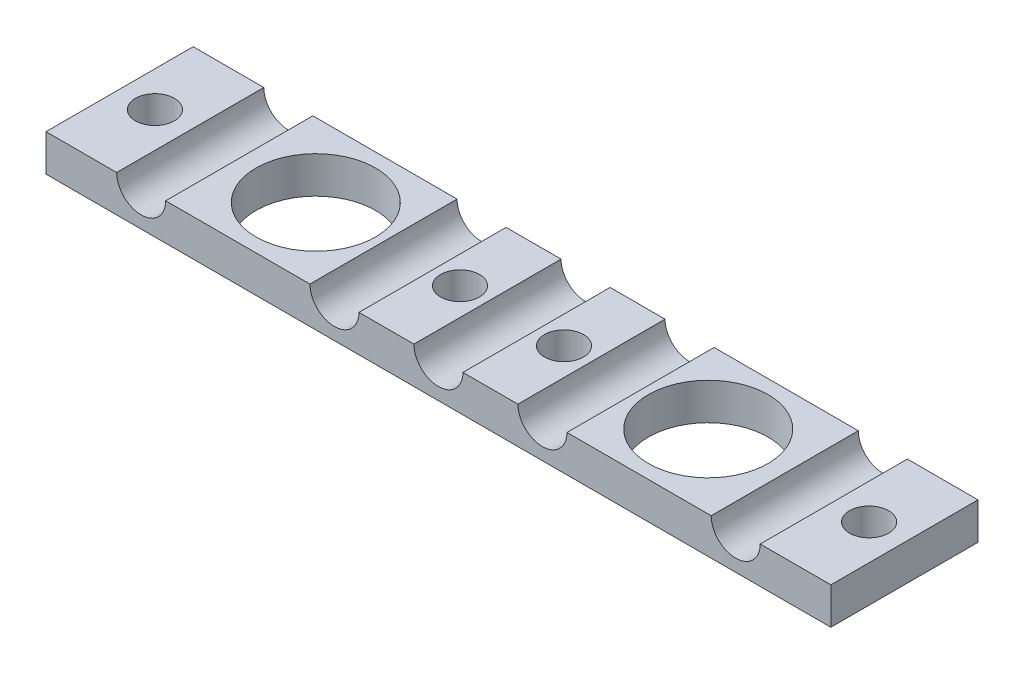
ISO-10303-21;
HEADER;
FILE_DESCRIPTION(('STEP AP214'),'2;1');
FILE_NAME('part.step','',(''),(''),'','','');
FILE_SCHEMA(('AUTOMOTIVE_DESIGN { 1 0 10303 214 1 1 1 1 }'));
ENDSEC;
DATA;
#1=APPLICATION_CONTEXT('core data for automotive mechanical design processes');
#2=APPLICATION_PROTOCOL_DEFINITION('international standard','automotive_design',2000,#1);
#3=PRODUCT_CONTEXT('',#1,'mechanical');
#4=PRODUCT('Part','Part','',(#3));
#5=PRODUCT_RELATED_PRODUCT_CATEGORY('part','',(#4));
#6=PRODUCT_DEFINITION_FORMATION('','',#4);
#7=PRODUCT_DEFINITION_CONTEXT('part definition',#1,'design');
#8=PRODUCT_DEFINITION('design','',#6,#7);
#9=PRODUCT_DEFINITION_SHAPE('','',#8);
#10=(LENGTH_UNIT() NAMED_UNIT(*) SI_UNIT(.MILLI.,.METRE.));
#11=(NAMED_UNIT(*) PLANE_ANGLE_UNIT() SI_UNIT($,.RADIAN.));
#12=(NAMED_UNIT(*) SI_UNIT($,.STERADIAN.) SOLID_ANGLE_UNIT());
#13=UNCERTAINTY_MEASURE_WITH_UNIT(LENGTH_MEASURE(1.E-05),#10,'distance_accuracy_value','');
#14=(GEOMETRIC_REPRESENTATION_CONTEXT(3) GLOBAL_UNCERTAINTY_ASSIGNED_CONTEXT((#13)) GLOBAL_UNIT_ASSIGNED_CONTEXT((#10,
#11,#12)) REPRESENTATION_CONTEXT('',''));
#15=CARTESIAN_POINT('',(0.,0.,0.));
#16=DIRECTION('',(0.,0.,1.));
#17=DIRECTION('',(1.,0.,0.));
#18=AXIS2_PLACEMENT_3D('',#15,#16,#17);
#19=CARTESIAN_POINT('',(-50.8,4.7625,9.52500000000001));
#20=DIRECTION('',(0.,1.,0.));
#21=DIRECTION('',(0.,0.,1.));
#22=AXIS2_PLACEMENT_3D('',#19,#20,#21);
#23=PLANE('',#22);
#24=CARTESIAN_POINT('',(-6.731,4.7625,0.));
#25=DIRECTION('',(0.,1.,0.));
#26=DIRECTION('',(0.,0.,1.));
#27=AXIS2_PLACEMENT_3D('',#24,#25,#26);
#28=CIRCLE('',#27,2.5273);
#29=CARTESIAN_POINT('',(-6.731,4.7625,2.5273));
#30=VERTEX_POINT('',#29);
#31=EDGE_CURVE('E246',#30,#30,#28,.T.);
#32=ORIENTED_EDGE('',*,*,#31,.F.);
#33=EDGE_LOOP('',(#32));
#34=FACE_BOUND('',#33,.T.);
#35=DIRECTION('',(0.,0.,1.));
#36=VECTOR('',#35,1.);
#37=CARTESIAN_POINT('',(-3.17499999999999,4.7625,9.52499999999999));
#38=LINE('',#37,#36);
#39=CARTESIAN_POINT('',(-3.17499999999999,4.7625,-9.52500000000001));
#40=VERTEX_POINT('',#39);
#41=CARTESIAN_POINT('',(-3.17499999999998,4.7625,9.52499999999999));
#42=VERTEX_POINT('',#41);
#43=EDGE_CURVE('E145',#40,#42,#38,.T.);
#44=ORIENTED_EDGE('',*,*,#43,.F.);
#45=DIRECTION('',(-1.,0.,0.));
#46=VECTOR('',#45,1.);
#47=CARTESIAN_POINT('',(-50.8,4.7625,-9.525));
#48=LINE('',#47,#46);
#49=CARTESIAN_POINT('',(-10.287,4.7625,-9.52499999999999));
#50=VERTEX_POINT('',#49);
#51=EDGE_CURVE('E67',#40,#50,#48,.T.);
#52=ORIENTED_EDGE('',*,*,#51,.T.);
#53=DIRECTION('',(0.,0.,1.));
#54=VECTOR('',#53,1.);
#55=CARTESIAN_POINT('',(-10.287,4.7625,9.52499999999999));
#56=LINE('',#55,#54);
#57=CARTESIAN_POINT('',(-10.287,4.7625,9.52499999999999));
#58=VERTEX_POINT('',#57);
#59=EDGE_CURVE('E231',#58,#50,#56,.F.);
#60=ORIENTED_EDGE('',*,*,#59,.F.);
#61=DIRECTION('',(1.,0.,0.));
#62=VECTOR('',#61,1.);
#63=CARTESIAN_POINT('',(-50.8,4.7625,9.52500000000001));
#64=LINE('',#63,#62);
#65=EDGE_CURVE('E152',#58,#42,#64,.T.);
#66=ORIENTED_EDGE('',*,*,#65,.T.);
#67=EDGE_LOOP('',(#44,#52,#60,#66));
#68=FACE_BOUND('',#67,.T.);
#69=ADVANCED_FACE('F45',(#34,#68),#23,.T.);
#70=DIRECTION('',(0.,0.,1.));
#71=VECTOR('',#70,1.);
#72=CARTESIAN_POINT('',(-16.637,4.7625,9.52499999999999));
#73=LINE('',#72,#71);
#74=CARTESIAN_POINT('',(-16.637,4.7625,-9.52500000000001));
#75=VERTEX_POINT('',#74);
#76=CARTESIAN_POINT('',(-16.637,4.7625,9.52499999999999));
#77=VERTEX_POINT('',#76);
#78=EDGE_CURVE('E229',#75,#77,#73,.T.);
#79=ORIENTED_EDGE('',*,*,#78,.F.);
#80=CARTESIAN_POINT('',(-35.306,4.7625,-9.52499999999999));
#81=VERTEX_POINT('',#80);
#82=EDGE_CURVE('E159',#75,#81,#48,.T.);
#83=ORIENTED_EDGE('',*,*,#82,.T.);
#84=DIRECTION('',(0.,0.,1.));
#85=VECTOR('',#84,1.);
#86=CARTESIAN_POINT('',(-35.306,4.7625,9.52499999999999));
#87=LINE('',#86,#85);
#88=CARTESIAN_POINT('',(-35.306,4.7625,9.52499999999999));
#89=VERTEX_POINT('',#88);
#90=EDGE_CURVE('E217',#89,#81,#87,.F.);
#91=ORIENTED_EDGE('',*,*,#90,.F.);
#92=EDGE_CURVE('E189',#89,#77,#64,.T.);
#93=ORIENTED_EDGE('',*,*,#92,.T.);
#94=EDGE_LOOP('',(#79,#83,#91,#93));
#95=FACE_BOUND('',#94,.T.);
#96=CARTESIAN_POINT('',(-25.4,4.7625,0.));
#97=DIRECTION('',(0.,1.,0.));
#98=DIRECTION('',(0.,0.,1.));
#99=AXIS2_PLACEMENT_3D('',#96,#97,#98);
#100=CIRCLE('',#99,7.73912599999999);
#101=CARTESIAN_POINT('',(-25.4,4.7625,7.73912599999999));
#102=VERTEX_POINT('',#101);
#103=EDGE_CURVE('E207',#102,#102,#100,.T.);
#104=ORIENTED_EDGE('',*,*,#103,.F.);
#105=EDGE_LOOP('',(#104));
#106=FACE_BOUND('',#105,.T.);
#107=ADVANCED_FACE('F334',(#95,#106),#23,.T.);
#108=CARTESIAN_POINT('',(6.731,4.7625,0.));
#109=DIRECTION('',(0.,1.,0.));
#110=DIRECTION('',(0.,0.,1.));
#111=AXIS2_PLACEMENT_3D('',#108,#109,#110);
#112=CIRCLE('',#111,2.5273);
#113=CARTESIAN_POINT('',(6.731,4.7625,2.5273));
#114=VERTEX_POINT('',#113);
#115=EDGE_CURVE('E252',#114,#114,#112,.T.);
#116=ORIENTED_EDGE('',*,*,#115,.F.);
#117=EDGE_LOOP('',(#116));
#118=FACE_BOUND('',#117,.T.);
#119=DIRECTION('',(0.,0.,1.));
#120=VECTOR('',#119,1.);
#121=CARTESIAN_POINT('',(3.17499999999999,4.7625,9.52499999999999));
#122=LINE('',#121,#120);
#123=CARTESIAN_POINT('',(3.17499999999999,4.7625,9.52499999999999));
#124=VERTEX_POINT('',#123);
#125=CARTESIAN_POINT('',(3.17499999999999,4.7625,-9.52499999999999));
#126=VERTEX_POINT('',#125);
#127=EDGE_CURVE('E60',#124,#126,#122,.F.);
#128=ORIENTED_EDGE('',*,*,#127,.F.);
#129=CARTESIAN_POINT('',(10.287,4.7625,9.52499999999999));
#130=VERTEX_POINT('',#129);
#131=EDGE_CURVE('E191',#124,#130,#64,.T.);
#132=ORIENTED_EDGE('',*,*,#131,.T.);
#133=DIRECTION('',(0.,0.,1.));
#134=VECTOR('',#133,1.);
#135=CARTESIAN_POINT('',(10.287,4.7625,9.52499999999999));
#136=LINE('',#135,#134);
#137=CARTESIAN_POINT('',(10.287,4.7625,-9.52500000000001));
#138=VERTEX_POINT('',#137);
#139=EDGE_CURVE('E222',#138,#130,#136,.T.);
#140=ORIENTED_EDGE('',*,*,#139,.F.);
#141=EDGE_CURVE('E158',#138,#126,#48,.T.);
#142=ORIENTED_EDGE('',*,*,#141,.T.);
#143=EDGE_LOOP('',(#128,#132,#140,#142));
#144=FACE_BOUND('',#143,.T.);
#145=ADVANCED_FACE('F291',(#118,#144),#23,.T.);
#146=CARTESIAN_POINT('',(-46.228,4.7625,0.));
#147=DIRECTION('',(0.,1.,0.));
#148=DIRECTION('',(0.,0.,1.));
#149=AXIS2_PLACEMENT_3D('',#146,#147,#148);
#150=CIRCLE('',#149,2.5273);
#151=CARTESIAN_POINT('',(-46.228,4.7625,2.5273));
#152=VERTEX_POINT('',#151);
#153=EDGE_CURVE('E240',#152,#152,#150,.T.);
#154=ORIENTED_EDGE('',*,*,#153,.F.);
#155=EDGE_LOOP('',(#154));
#156=FACE_BOUND('',#155,.T.);
#157=DIRECTION('',(0.,0.,1.));
#158=VECTOR('',#157,1.);
#159=CARTESIAN_POINT('',(-41.656,4.7625,9.52499999999999));
#160=LINE('',#159,#158);
#161=CARTESIAN_POINT('',(-41.656,4.7625,-9.52500000000001));
#162=VERTEX_POINT('',#161);
#163=CARTESIAN_POINT('',(-41.656,4.7625,9.52499999999999));
#164=VERTEX_POINT('',#163);
#165=EDGE_CURVE('E215',#162,#164,#160,.T.);
#166=ORIENTED_EDGE('',*,*,#165,.F.);
#167=CARTESIAN_POINT('',(-50.8,4.7625,-9.525));
#168=VERTEX_POINT('',#167);
#169=EDGE_CURVE('E163',#162,#168,#48,.T.);
#170=ORIENTED_EDGE('',*,*,#169,.T.);
#171=DIRECTION('',(0.,0.,1.));
#172=VECTOR('',#171,1.);
#173=CARTESIAN_POINT('',(-50.8,4.7625,-9.525));
#174=LINE('',#173,#172);
#175=CARTESIAN_POINT('',(-50.8,4.7625,9.52500000000001));
#176=VERTEX_POINT('',#175);
#177=EDGE_CURVE('E194',#168,#176,#174,.T.);
#178=ORIENTED_EDGE('',*,*,#177,.T.);
#179=EDGE_CURVE('E185',#176,#164,#64,.T.);
#180=ORIENTED_EDGE('',*,*,#179,.T.);
#181=EDGE_LOOP('',(#166,#170,#178,#180));
#182=FACE_BOUND('',#181,.T.);
#183=ADVANCED_FACE('F327',(#156,#182),#23,.T.);
#184=DIRECTION('',(0.,0.,1.));
#185=VECTOR('',#184,1.);
#186=CARTESIAN_POINT('',(16.637,4.7625,9.52499999999999));
#187=LINE('',#186,#185);
#188=CARTESIAN_POINT('',(16.637,4.7625,9.52499999999999));
#189=VERTEX_POINT('',#188);
#190=CARTESIAN_POINT('',(16.637,4.7625,-9.52499999999999));
#191=VERTEX_POINT('',#190);
#192=EDGE_CURVE('E225',#189,#191,#187,.F.);
#193=ORIENTED_EDGE('',*,*,#192,.F.);
#194=CARTESIAN_POINT('',(35.306,4.7625,9.52499999999999));
#195=VERTEX_POINT('',#194);
#196=EDGE_CURVE('E283',#189,#195,#64,.T.);
#197=ORIENTED_EDGE('',*,*,#196,.T.);
#198=DIRECTION('',(0.,0.,1.));
#199=VECTOR('',#198,1.);
#200=CARTESIAN_POINT('',(35.306,4.7625,9.52499999999999));
#201=LINE('',#200,#199);
#202=CARTESIAN_POINT('',(35.306,4.7625,-9.52500000000001));
#203=VERTEX_POINT('',#202);
#204=EDGE_CURVE('E273',#203,#195,#201,.T.);
#205=ORIENTED_EDGE('',*,*,#204,.F.);
#206=EDGE_CURVE('E162',#203,#191,#48,.T.);
#207=ORIENTED_EDGE('',*,*,#206,.T.);
#208=EDGE_LOOP('',(#193,#197,#205,#207));
#209=FACE_BOUND('',#208,.T.);
#210=CARTESIAN_POINT('',(25.4,4.7625,0.));
#211=DIRECTION('',(0.,1.,0.));
#212=DIRECTION('',(0.,0.,1.));
#213=AXIS2_PLACEMENT_3D('',#210,#211,#212);
#214=CIRCLE('',#213,7.73912599999998);
#215=CARTESIAN_POINT('',(25.4,4.7625,7.73912599999998));
#216=VERTEX_POINT('',#215);
#217=EDGE_CURVE('E201',#216,#216,#214,.T.);
#218=ORIENTED_EDGE('',*,*,#217,.F.);
#219=EDGE_LOOP('',(#218));
#220=FACE_BOUND('',#219,.T.);
#221=ADVANCED_FACE('F268',(#209,#220),#23,.T.);
#222=CARTESIAN_POINT('',(-50.8,4.7625,-9.525));
#223=DIRECTION('',(1.,0.,0.));
#224=DIRECTION('',(0.,0.,-1.));
#225=AXIS2_PLACEMENT_3D('',#222,#223,#224);
#226=PLANE('',#225);
#227=DIRECTION('',(0.,0.,1.));
#228=VECTOR('',#227,1.);
#229=CARTESIAN_POINT('',(-50.8,0.,-9.525));
#230=LINE('',#229,#228);
#231=CARTESIAN_POINT('',(-50.8,0.,-9.525));
#232=VERTEX_POINT('',#231);
#233=CARTESIAN_POINT('',(-50.8,0.,9.52500000000001));
#234=VERTEX_POINT('',#233);
#235=EDGE_CURVE('E200',#232,#234,#230,.T.);
#236=ORIENTED_EDGE('',*,*,#235,.T.);
#237=DIRECTION('',(0.,-1.,0.));
#238=VECTOR('',#237,1.);
#239=CARTESIAN_POINT('',(-50.8,4.7625,9.52500000000001));
#240=LINE('',#239,#238);
#241=EDGE_CURVE('E274',#176,#234,#240,.T.);
#242=ORIENTED_EDGE('',*,*,#241,.F.);
#243=ORIENTED_EDGE('',*,*,#177,.F.);
#244=DIRECTION('',(0.,-1.,0.));
#245=VECTOR('',#244,1.);
#246=CARTESIAN_POINT('',(-50.8,4.7625,-9.525));
#247=LINE('',#246,#245);
#248=EDGE_CURVE('E167',#168,#232,#247,.T.);
#249=ORIENTED_EDGE('',*,*,#248,.T.);
#250=EDGE_LOOP('',(#236,#242,#243,#249));
#251=FACE_BOUND('',#250,.T.);
#252=ADVANCED_FACE('F47',(#251),#226,.F.);
#253=CARTESIAN_POINT('',(-50.8,4.7625,9.52500000000001));
#254=DIRECTION('',(0.,0.,-1.));
#255=DIRECTION('',(-1.,0.,0.));
#256=AXIS2_PLACEMENT_3D('',#253,#254,#255);
#257=PLANE('',#256);
#258=ORIENTED_EDGE('',*,*,#131,.F.);
#259=CARTESIAN_POINT('',(0.,4.7625,9.52499999999999));
#260=DIRECTION('',(0.,0.,1.));
#261=DIRECTION('',(1.,0.,0.));
#262=AXIS2_PLACEMENT_3D('',#259,#260,#261);
#263=CIRCLE('',#262,3.17499999999999);
#264=EDGE_CURVE('E235',#42,#124,#263,.T.);
#265=ORIENTED_EDGE('',*,*,#264,.F.);
#266=ORIENTED_EDGE('',*,*,#65,.F.);
#267=CARTESIAN_POINT('',(-13.462,4.7625,9.52499999999999));
#268=DIRECTION('',(0.,0.,1.));
#269=DIRECTION('',(1.,0.,0.));
#270=AXIS2_PLACEMENT_3D('',#267,#268,#269);
#271=CIRCLE('',#270,3.17499999999999);
#272=EDGE_CURVE('E153',#77,#58,#271,.T.);
#273=ORIENTED_EDGE('',*,*,#272,.F.);
#274=ORIENTED_EDGE('',*,*,#92,.F.);
#275=CARTESIAN_POINT('',(-38.481,4.7625,9.52499999999999));
#276=DIRECTION('',(0.,0.,1.));
#277=DIRECTION('',(1.,0.,0.));
#278=AXIS2_PLACEMENT_3D('',#275,#276,#277);
#279=CIRCLE('',#278,3.17499999999999);
#280=EDGE_CURVE('E220',#164,#89,#279,.T.);
#281=ORIENTED_EDGE('',*,*,#280,.F.);
#282=ORIENTED_EDGE('',*,*,#179,.F.);
#283=ORIENTED_EDGE('',*,*,#241,.T.);
#284=DIRECTION('',(1.,0.,0.));
#285=VECTOR('',#284,1.);
#286=CARTESIAN_POINT('',(-50.8,0.,9.52500000000001));
#287=LINE('',#286,#285);
#288=CARTESIAN_POINT('',(50.8,0.,9.52499999999997));
#289=VERTEX_POINT('',#288);
#290=EDGE_CURVE('E316',#234,#289,#287,.T.);
#291=ORIENTED_EDGE('',*,*,#290,.T.);
#292=DIRECTION('',(0.,-1.,0.));
#293=VECTOR('',#292,1.);
#294=CARTESIAN_POINT('',(50.8,4.7625,9.52499999999997));
#295=LINE('',#294,#293);
#296=CARTESIAN_POINT('',(50.8,4.7625,9.52499999999997));
#297=VERTEX_POINT('',#296);
#298=EDGE_CURVE('E282',#297,#289,#295,.T.);
#299=ORIENTED_EDGE('',*,*,#298,.F.);
#300=CARTESIAN_POINT('',(41.656,4.7625,9.52499999999998));
#301=VERTEX_POINT('',#300);
#302=EDGE_CURVE('E192',#301,#297,#64,.T.);
#303=ORIENTED_EDGE('',*,*,#302,.F.);
#304=CARTESIAN_POINT('',(38.481,4.7625,9.52499999999999));
#305=DIRECTION('',(0.,0.,1.));
#306=DIRECTION('',(1.,0.,0.));
#307=AXIS2_PLACEMENT_3D('',#304,#305,#306);
#308=CIRCLE('',#307,3.17499999999999);
#309=EDGE_CURVE('E213',#195,#301,#308,.T.);
#310=ORIENTED_EDGE('',*,*,#309,.F.);
#311=ORIENTED_EDGE('',*,*,#196,.F.);
#312=CARTESIAN_POINT('',(13.462,4.7625,9.52499999999999));
#313=DIRECTION('',(0.,0.,1.));
#314=DIRECTION('',(1.,0.,0.));
#315=AXIS2_PLACEMENT_3D('',#312,#313,#314);
#316=CIRCLE('',#315,3.17499999999999);
#317=EDGE_CURVE('E227',#130,#189,#316,.T.);
#318=ORIENTED_EDGE('',*,*,#317,.F.);
#319=EDGE_LOOP('',(#258,#265,#266,#273,#274,#281,#282,#283,#291,#299,#303,#310,#311,#318));
#320=FACE_BOUND('',#319,.T.);
#321=ADVANCED_FACE('F279',(#320),#257,.F.);
#322=CARTESIAN_POINT('',(50.8,4.7625,-9.52499999999999));
#323=DIRECTION('',(-1.,0.,0.));
#324=DIRECTION('',(0.,0.,1.));
#325=AXIS2_PLACEMENT_3D('',#322,#323,#324);
#326=PLANE('',#325);
#327=DIRECTION('',(0.,0.,-1.));
#328=VECTOR('',#327,1.);
#329=CARTESIAN_POINT('',(50.8,0.,-9.52499999999999));
#330=LINE('',#329,#328);
#331=CARTESIAN_POINT('',(50.8,0.,-9.52499999999999));
#332=VERTEX_POINT('',#331);
#333=EDGE_CURVE('E313',#289,#332,#330,.T.);
#334=ORIENTED_EDGE('',*,*,#333,.T.);
#335=DIRECTION('',(0.,-1.,0.));
#336=VECTOR('',#335,1.);
#337=CARTESIAN_POINT('',(50.8,4.7625,-9.52499999999999));
#338=LINE('',#337,#336);
#339=CARTESIAN_POINT('',(50.8,4.7625,-9.52499999999999));
#340=VERTEX_POINT('',#339);
#341=EDGE_CURVE('E172',#340,#332,#338,.T.);
#342=ORIENTED_EDGE('',*,*,#341,.F.);
#343=DIRECTION('',(0.,0.,-1.));
#344=VECTOR('',#343,1.);
#345=CARTESIAN_POINT('',(50.8,4.7625,-9.52499999999999));
#346=LINE('',#345,#344);
#347=EDGE_CURVE('E179',#297,#340,#346,.T.);
#348=ORIENTED_EDGE('',*,*,#347,.F.);
#349=ORIENTED_EDGE('',*,*,#298,.T.);
#350=EDGE_LOOP('',(#334,#342,#348,#349));
#351=FACE_BOUND('',#350,.T.);
#352=ADVANCED_FACE('F395',(#351),#326,.F.);
#353=CARTESIAN_POINT('',(-50.8,4.7625,-9.525));
#354=DIRECTION('',(0.,0.,1.));
#355=DIRECTION('',(1.,0.,0.));
#356=AXIS2_PLACEMENT_3D('',#353,#354,#355);
#357=PLANE('',#356);
#358=ORIENTED_EDGE('',*,*,#51,.F.);
#359=CARTESIAN_POINT('',(0.,4.7625,-9.52499999999999));
#360=DIRECTION('',(0.,0.,1.));
#361=DIRECTION('',(1.,0.,0.));
#362=AXIS2_PLACEMENT_3D('',#359,#360,#361);
#363=CIRCLE('',#362,3.17499999999999);
#364=EDGE_CURVE('E13',#40,#126,#363,.T.);
#365=ORIENTED_EDGE('',*,*,#364,.T.);
#366=ORIENTED_EDGE('',*,*,#141,.F.);
#367=CARTESIAN_POINT('',(13.462,4.7625,-9.52499999999999));
#368=DIRECTION('',(0.,0.,1.));
#369=DIRECTION('',(1.,0.,0.));
#370=AXIS2_PLACEMENT_3D('',#367,#368,#369);
#371=CIRCLE('',#370,3.17499999999999);
#372=EDGE_CURVE('E296',#138,#191,#371,.T.);
#373=ORIENTED_EDGE('',*,*,#372,.T.);
#374=ORIENTED_EDGE('',*,*,#206,.F.);
#375=CARTESIAN_POINT('',(38.481,4.7625,-9.52500000000001));
#376=DIRECTION('',(0.,0.,1.));
#377=DIRECTION('',(1.,0.,0.));
#378=AXIS2_PLACEMENT_3D('',#375,#376,#377);
#379=CIRCLE('',#378,3.175);
#380=CARTESIAN_POINT('',(41.656,4.7625,-9.52500000000001));
#381=VERTEX_POINT('',#380);
#382=EDGE_CURVE('E210',#203,#381,#379,.T.);
#383=ORIENTED_EDGE('',*,*,#382,.T.);
#384=EDGE_CURVE('E161',#340,#381,#48,.T.);
#385=ORIENTED_EDGE('',*,*,#384,.F.);
#386=ORIENTED_EDGE('',*,*,#341,.T.);
#387=DIRECTION('',(-1.,0.,0.));
#388=VECTOR('',#387,1.);
#389=CARTESIAN_POINT('',(-50.8,0.,-9.525));
#390=LINE('',#389,#388);
#391=EDGE_CURVE('E196',#332,#232,#390,.T.);
#392=ORIENTED_EDGE('',*,*,#391,.T.);
#393=ORIENTED_EDGE('',*,*,#248,.F.);
#394=ORIENTED_EDGE('',*,*,#169,.F.);
#395=CARTESIAN_POINT('',(-38.481,4.7625,-9.52499999999999));
#396=DIRECTION('',(0.,0.,1.));
#397=DIRECTION('',(1.,0.,0.));
#398=AXIS2_PLACEMENT_3D('',#395,#396,#397);
#399=CIRCLE('',#398,3.17499999999999);
#400=EDGE_CURVE('E300',#162,#81,#399,.T.);
#401=ORIENTED_EDGE('',*,*,#400,.T.);
#402=ORIENTED_EDGE('',*,*,#82,.F.);
#403=CARTESIAN_POINT('',(-13.462,4.7625,-9.52499999999999));
#404=DIRECTION('',(0.,0.,1.));
#405=DIRECTION('',(1.,0.,0.));
#406=AXIS2_PLACEMENT_3D('',#403,#404,#405);
#407=CIRCLE('',#406,3.17499999999999);
#408=EDGE_CURVE('E53',#75,#50,#407,.T.);
#409=ORIENTED_EDGE('',*,*,#408,.T.);
#410=EDGE_LOOP('',(#358,#365,#366,#373,#374,#383,#385,#386,#392,#393,#394,#401,#402,#409));
#411=FACE_BOUND('',#410,.T.);
#412=ADVANCED_FACE('F156',(#411),#357,.F.);
#413=CARTESIAN_POINT('',(46.228,4.7625,0.));
#414=DIRECTION('',(0.,1.,0.));
#415=DIRECTION('',(0.,0.,1.));
#416=AXIS2_PLACEMENT_3D('',#413,#414,#415);
#417=CIRCLE('',#416,2.5273);
#418=CARTESIAN_POINT('',(46.228,4.7625,2.5273));
#419=VERTEX_POINT('',#418);
#420=EDGE_CURVE('E258',#419,#419,#417,.T.);
#421=ORIENTED_EDGE('',*,*,#420,.F.);
#422=EDGE_LOOP('',(#421));
#423=FACE_BOUND('',#422,.T.);
#424=DIRECTION('',(0.,0.,1.));
#425=VECTOR('',#424,1.);
#426=CARTESIAN_POINT('',(41.656,4.7625,9.52499999999999));
#427=LINE('',#426,#425);
#428=EDGE_CURVE('E269',#301,#381,#427,.F.);
#429=ORIENTED_EDGE('',*,*,#428,.F.);
#430=ORIENTED_EDGE('',*,*,#302,.T.);
#431=ORIENTED_EDGE('',*,*,#347,.T.);
#432=ORIENTED_EDGE('',*,*,#384,.T.);
#433=EDGE_LOOP('',(#429,#430,#431,#432));
#434=FACE_BOUND('',#433,.T.);
#435=ADVANCED_FACE('F264',(#423,#434),#23,.T.);
#436=CARTESIAN_POINT('',(-50.8,0.,9.52500000000001));
#437=DIRECTION('',(0.,1.,0.));
#438=DIRECTION('',(0.,0.,1.));
#439=AXIS2_PLACEMENT_3D('',#436,#437,#438);
#440=PLANE('',#439);
#441=CARTESIAN_POINT('',(46.228,0.,0.));
#442=DIRECTION('',(0.,1.,0.));
#443=DIRECTION('',(0.,0.,1.));
#444=AXIS2_PLACEMENT_3D('',#441,#442,#443);
#445=CIRCLE('',#444,2.5273);
#446=CARTESIAN_POINT('',(46.228,0.,2.5273));
#447=VERTEX_POINT('',#446);
#448=EDGE_CURVE('E255',#447,#447,#445,.T.);
#449=ORIENTED_EDGE('',*,*,#448,.T.);
#450=EDGE_LOOP('',(#449));
#451=FACE_BOUND('',#450,.T.);
#452=CARTESIAN_POINT('',(6.731,0.,0.));
#453=DIRECTION('',(0.,1.,0.));
#454=DIRECTION('',(0.,0.,1.));
#455=AXIS2_PLACEMENT_3D('',#452,#453,#454);
#456=CIRCLE('',#455,2.5273);
#457=CARTESIAN_POINT('',(6.731,0.,2.5273));
#458=VERTEX_POINT('',#457);
#459=EDGE_CURVE('E249',#458,#458,#456,.T.);
#460=ORIENTED_EDGE('',*,*,#459,.T.);
#461=EDGE_LOOP('',(#460));
#462=FACE_BOUND('',#461,.T.);
#463=CARTESIAN_POINT('',(-6.731,0.,0.));
#464=DIRECTION('',(0.,1.,0.));
#465=DIRECTION('',(0.,0.,1.));
#466=AXIS2_PLACEMENT_3D('',#463,#464,#465);
#467=CIRCLE('',#466,2.5273);
#468=CARTESIAN_POINT('',(-6.731,0.,2.5273));
#469=VERTEX_POINT('',#468);
#470=EDGE_CURVE('E243',#469,#469,#467,.T.);
#471=ORIENTED_EDGE('',*,*,#470,.T.);
#472=EDGE_LOOP('',(#471));
#473=FACE_BOUND('',#472,.T.);
#474=CARTESIAN_POINT('',(-46.228,0.,0.));
#475=DIRECTION('',(0.,1.,0.));
#476=DIRECTION('',(0.,0.,1.));
#477=AXIS2_PLACEMENT_3D('',#474,#475,#476);
#478=CIRCLE('',#477,2.5273);
#479=CARTESIAN_POINT('',(-46.228,0.,2.5273));
#480=VERTEX_POINT('',#479);
#481=EDGE_CURVE('E237',#480,#480,#478,.T.);
#482=ORIENTED_EDGE('',*,*,#481,.T.);
#483=EDGE_LOOP('',(#482));
#484=FACE_BOUND('',#483,.T.);
#485=CARTESIAN_POINT('',(-25.4,0.,0.));
#486=DIRECTION('',(0.,1.,0.));
#487=DIRECTION('',(0.,0.,1.));
#488=AXIS2_PLACEMENT_3D('',#485,#486,#487);
#489=CIRCLE('',#488,7.739126);
#490=CARTESIAN_POINT('',(-25.4,0.,7.739126));
#491=VERTEX_POINT('',#490);
#492=EDGE_CURVE('E204',#491,#491,#489,.T.);
#493=ORIENTED_EDGE('',*,*,#492,.T.);
#494=EDGE_LOOP('',(#493));
#495=FACE_BOUND('',#494,.T.);
#496=CARTESIAN_POINT('',(25.4,0.,0.));
#497=DIRECTION('',(0.,1.,0.));
#498=DIRECTION('',(0.,0.,1.));
#499=AXIS2_PLACEMENT_3D('',#496,#497,#498);
#500=CIRCLE('',#499,7.739126);
#501=CARTESIAN_POINT('',(25.4,0.,7.73912599999999));
#502=VERTEX_POINT('',#501);
#503=EDGE_CURVE('E197',#502,#502,#500,.T.);
#504=ORIENTED_EDGE('',*,*,#503,.T.);
#505=EDGE_LOOP('',(#504));
#506=FACE_BOUND('',#505,.T.);
#507=ORIENTED_EDGE('',*,*,#235,.F.);
#508=ORIENTED_EDGE('',*,*,#391,.F.);
#509=ORIENTED_EDGE('',*,*,#333,.F.);
#510=ORIENTED_EDGE('',*,*,#290,.F.);
#511=EDGE_LOOP('',(#507,#508,#509,#510));
#512=FACE_BOUND('',#511,.T.);
#513=ADVANCED_FACE('F266',(#451,#462,#473,#484,#495,#506,#512),#440,.F.);
#514=CARTESIAN_POINT('',(25.4,4.7625,0.));
#515=DIRECTION('',(0.,1.,0.));
#516=DIRECTION('',(0.,0.,1.));
#517=AXIS2_PLACEMENT_3D('',#514,#515,#516);
#518=CYLINDRICAL_SURFACE('',#517,7.73912599999999);
#519=ORIENTED_EDGE('',*,*,#503,.F.);
#520=EDGE_LOOP('',(#519));
#521=FACE_BOUND('',#520,.T.);
#522=ORIENTED_EDGE('',*,*,#217,.T.);
#523=EDGE_LOOP('',(#522));
#524=FACE_BOUND('',#523,.T.);
#525=ADVANCED_FACE('F377',(#521,#524),#518,.F.);
#526=CARTESIAN_POINT('',(-25.4,4.7625,0.));
#527=DIRECTION('',(0.,1.,0.));
#528=DIRECTION('',(0.,0.,1.));
#529=AXIS2_PLACEMENT_3D('',#526,#527,#528);
#530=CYLINDRICAL_SURFACE('',#529,7.73912599999999);
#531=ORIENTED_EDGE('',*,*,#492,.F.);
#532=EDGE_LOOP('',(#531));
#533=FACE_BOUND('',#532,.T.);
#534=ORIENTED_EDGE('',*,*,#103,.T.);
#535=EDGE_LOOP('',(#534));
#536=FACE_BOUND('',#535,.T.);
#537=ADVANCED_FACE('F375',(#533,#536),#530,.F.);
#538=CARTESIAN_POINT('',(38.481,4.7625,9.52499999999999));
#539=DIRECTION('',(0.,0.,1.));
#540=DIRECTION('',(1.,0.,0.));
#541=AXIS2_PLACEMENT_3D('',#538,#539,#540);
#542=CYLINDRICAL_SURFACE('',#541,3.17499999999999);
#543=ORIENTED_EDGE('',*,*,#204,.T.);
#544=ORIENTED_EDGE('',*,*,#309,.T.);
#545=ORIENTED_EDGE('',*,*,#428,.T.);
#546=ORIENTED_EDGE('',*,*,#382,.F.);
#547=EDGE_LOOP('',(#543,#544,#545,#546));
#548=FACE_BOUND('',#547,.T.);
#549=ADVANCED_FACE('F299',(#548),#542,.F.);
#550=CARTESIAN_POINT('',(-38.481,4.7625,9.52499999999999));
#551=DIRECTION('',(0.,0.,1.));
#552=DIRECTION('',(1.,0.,0.));
#553=AXIS2_PLACEMENT_3D('',#550,#551,#552);
#554=CYLINDRICAL_SURFACE('',#553,3.17499999999999);
#555=ORIENTED_EDGE('',*,*,#165,.T.);
#556=ORIENTED_EDGE('',*,*,#280,.T.);
#557=ORIENTED_EDGE('',*,*,#90,.T.);
#558=ORIENTED_EDGE('',*,*,#400,.F.);
#559=EDGE_LOOP('',(#555,#556,#557,#558));
#560=FACE_BOUND('',#559,.T.);
#561=ADVANCED_FACE('F326',(#560),#554,.F.);
#562=CARTESIAN_POINT('',(13.462,4.7625,9.52499999999999));
#563=DIRECTION('',(0.,0.,1.));
#564=DIRECTION('',(1.,0.,0.));
#565=AXIS2_PLACEMENT_3D('',#562,#563,#564);
#566=CYLINDRICAL_SURFACE('',#565,3.17499999999999);
#567=ORIENTED_EDGE('',*,*,#139,.T.);
#568=ORIENTED_EDGE('',*,*,#317,.T.);
#569=ORIENTED_EDGE('',*,*,#192,.T.);
#570=ORIENTED_EDGE('',*,*,#372,.F.);
#571=EDGE_LOOP('',(#567,#568,#569,#570));
#572=FACE_BOUND('',#571,.T.);
#573=ADVANCED_FACE('F294',(#572),#566,.F.);
#574=CARTESIAN_POINT('',(-13.462,4.7625,9.52499999999999));
#575=DIRECTION('',(0.,0.,1.));
#576=DIRECTION('',(1.,0.,0.));
#577=AXIS2_PLACEMENT_3D('',#574,#575,#576);
#578=CYLINDRICAL_SURFACE('',#577,3.17499999999999);
#579=ORIENTED_EDGE('',*,*,#78,.T.);
#580=ORIENTED_EDGE('',*,*,#272,.T.);
#581=ORIENTED_EDGE('',*,*,#59,.T.);
#582=ORIENTED_EDGE('',*,*,#408,.F.);
#583=EDGE_LOOP('',(#579,#580,#581,#582));
#584=FACE_BOUND('',#583,.T.);
#585=ADVANCED_FACE('F365',(#584),#578,.F.);
#586=CARTESIAN_POINT('',(0.,4.7625,9.52499999999999));
#587=DIRECTION('',(0.,0.,1.));
#588=DIRECTION('',(1.,0.,0.));
#589=AXIS2_PLACEMENT_3D('',#586,#587,#588);
#590=CYLINDRICAL_SURFACE('',#589,3.17499999999999);
#591=ORIENTED_EDGE('',*,*,#43,.T.);
#592=ORIENTED_EDGE('',*,*,#264,.T.);
#593=ORIENTED_EDGE('',*,*,#127,.T.);
#594=ORIENTED_EDGE('',*,*,#364,.F.);
#595=EDGE_LOOP('',(#591,#592,#593,#594));
#596=FACE_BOUND('',#595,.T.);
#597=ADVANCED_FACE('F144',(#596),#590,.F.);
#598=CARTESIAN_POINT('',(-46.228,4.7625,0.));
#599=DIRECTION('',(0.,1.,0.));
#600=DIRECTION('',(0.,0.,1.));
#601=AXIS2_PLACEMENT_3D('',#598,#599,#600);
#602=CYLINDRICAL_SURFACE('',#601,2.5273);
#603=ORIENTED_EDGE('',*,*,#481,.F.);
#604=EDGE_LOOP('',(#603));
#605=FACE_BOUND('',#604,.T.);
#606=ORIENTED_EDGE('',*,*,#153,.T.);
#607=EDGE_LOOP('',(#606));
#608=FACE_BOUND('',#607,.T.);
#609=ADVANCED_FACE('F349',(#605,#608),#602,.F.);
#610=CARTESIAN_POINT('',(-6.731,4.7625,0.));
#611=DIRECTION('',(0.,1.,0.));
#612=DIRECTION('',(0.,0.,1.));
#613=AXIS2_PLACEMENT_3D('',#610,#611,#612);
#614=CYLINDRICAL_SURFACE('',#613,2.5273);
#615=ORIENTED_EDGE('',*,*,#470,.F.);
#616=EDGE_LOOP('',(#615));
#617=FACE_BOUND('',#616,.T.);
#618=ORIENTED_EDGE('',*,*,#31,.T.);
#619=EDGE_LOOP('',(#618));
#620=FACE_BOUND('',#619,.T.);
#621=ADVANCED_FACE('F346',(#617,#620),#614,.F.);
#622=CARTESIAN_POINT('',(6.731,4.7625,0.));
#623=DIRECTION('',(0.,1.,0.));
#624=DIRECTION('',(0.,0.,1.));
#625=AXIS2_PLACEMENT_3D('',#622,#623,#624);
#626=CYLINDRICAL_SURFACE('',#625,2.5273);
#627=ORIENTED_EDGE('',*,*,#459,.F.);
#628=EDGE_LOOP('',(#627));
#629=FACE_BOUND('',#628,.T.);
#630=ORIENTED_EDGE('',*,*,#115,.T.);
#631=EDGE_LOOP('',(#630));
#632=FACE_BOUND('',#631,.T.);
#633=ADVANCED_FACE('F348',(#629,#632),#626,.F.);
#634=CARTESIAN_POINT('',(46.228,4.7625,0.));
#635=DIRECTION('',(0.,1.,0.));
#636=DIRECTION('',(0.,0.,1.));
#637=AXIS2_PLACEMENT_3D('',#634,#635,#636);
#638=CYLINDRICAL_SURFACE('',#637,2.5273);
#639=ORIENTED_EDGE('',*,*,#448,.F.);
#640=EDGE_LOOP('',(#639));
#641=FACE_BOUND('',#640,.T.);
#642=ORIENTED_EDGE('',*,*,#420,.T.);
#643=EDGE_LOOP('',(#642));
#644=FACE_BOUND('',#643,.T.);
#645=ADVANCED_FACE('F262',(#641,#644),#638,.F.);
#646=CLOSED_SHELL('',(#69,#107,#145,#183,#221,#252,#321,#352,#412,#435,#513,#525,#537,#549,#561,
#573,#585,#597,#609,#621,#633,#645));
#647=MANIFOLD_SOLID_BREP('B2',#646);
#648=ADVANCED_BREP_SHAPE_REPRESENTATION('',(#18,#647),#14);
#649=SHAPE_DEFINITION_REPRESENTATION(#9,#648);
ENDSEC;
END-ISO-10303-21;
